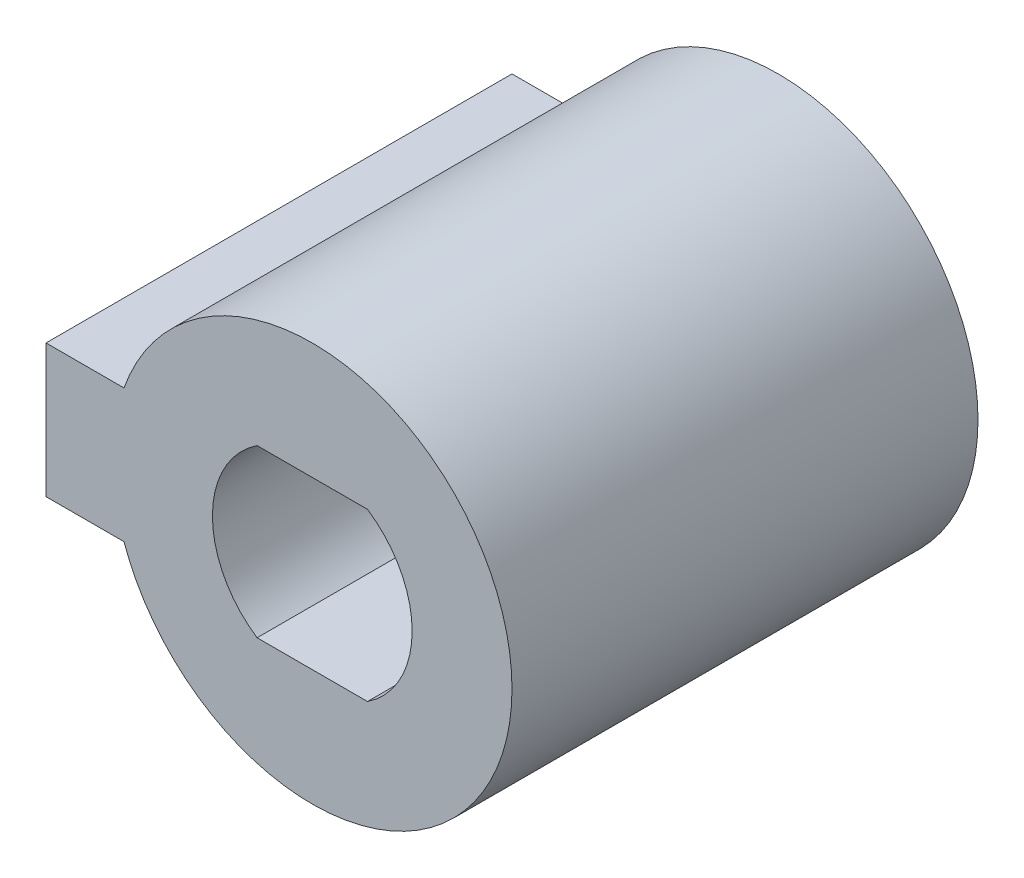
ISO-10303-21;
HEADER;
FILE_DESCRIPTION(('STEP AP214'),'2;1');
FILE_NAME('part.step','',(''),(''),'','','');
FILE_SCHEMA(('AUTOMOTIVE_DESIGN { 1 0 10303 214 1 1 1 1 }'));
ENDSEC;
DATA;
#1=APPLICATION_CONTEXT('core data for automotive mechanical design processes');
#2=APPLICATION_PROTOCOL_DEFINITION('international standard','automotive_design',2000,#1);
#3=PRODUCT_CONTEXT('',#1,'mechanical');
#4=PRODUCT('Part','Part','',(#3));
#5=PRODUCT_RELATED_PRODUCT_CATEGORY('part','',(#4));
#6=PRODUCT_DEFINITION_FORMATION('','',#4);
#7=PRODUCT_DEFINITION_CONTEXT('part definition',#1,'design');
#8=PRODUCT_DEFINITION('design','',#6,#7);
#9=PRODUCT_DEFINITION_SHAPE('','',#8);
#10=(LENGTH_UNIT() NAMED_UNIT(*) SI_UNIT(.MILLI.,.METRE.));
#11=(NAMED_UNIT(*) PLANE_ANGLE_UNIT() SI_UNIT($,.RADIAN.));
#12=(NAMED_UNIT(*) SI_UNIT($,.STERADIAN.) SOLID_ANGLE_UNIT());
#13=UNCERTAINTY_MEASURE_WITH_UNIT(LENGTH_MEASURE(1.E-05),#10,'distance_accuracy_value','');
#14=(GEOMETRIC_REPRESENTATION_CONTEXT(3) GLOBAL_UNCERTAINTY_ASSIGNED_CONTEXT((#13)) GLOBAL_UNIT_ASSIGNED_CONTEXT((#10,
#11,#12)) REPRESENTATION_CONTEXT('',''));
#15=CARTESIAN_POINT('',(0.,0.,0.));
#16=DIRECTION('',(0.,0.,1.));
#17=DIRECTION('',(1.,0.,0.));
#18=AXIS2_PLACEMENT_3D('',#15,#16,#17);
#19=CARTESIAN_POINT('',(0.,0.,-1.));
#20=DIRECTION('',(0.,0.,1.));
#21=DIRECTION('',(1.,0.,0.));
#22=AXIS2_PLACEMENT_3D('',#19,#20,#21);
#23=CYLINDRICAL_SURFACE('',#22,12.);
#24=DIRECTION('',(0.,0.,1.));
#25=VECTOR('',#24,1.);
#26=CARTESIAN_POINT('',(-11.3137084989848,4.,-1.));
#27=LINE('',#26,#25);
#28=CARTESIAN_POINT('',(-11.3137084989848,4.,-1.));
#29=VERTEX_POINT('',#28);
#30=CARTESIAN_POINT('',(-11.3137084989848,4.,27.));
#31=VERTEX_POINT('',#30);
#32=EDGE_CURVE('E39',#29,#31,#27,.T.);
#33=ORIENTED_EDGE('',*,*,#32,.T.);
#34=CARTESIAN_POINT('',(0.,0.,27.));
#35=DIRECTION('',(0.,0.,1.));
#36=DIRECTION('',(1.,0.,0.));
#37=AXIS2_PLACEMENT_3D('',#34,#35,#36);
#38=CIRCLE('',#37,12.);
#39=CARTESIAN_POINT('',(-11.3137084989848,-4.,27.));
#40=VERTEX_POINT('',#39);
#41=EDGE_CURVE('E122',#40,#31,#38,.T.);
#42=ORIENTED_EDGE('',*,*,#41,.F.);
#43=DIRECTION('',(0.,0.,1.));
#44=VECTOR('',#43,1.);
#45=CARTESIAN_POINT('',(-11.3137084989848,-4.,-1.));
#46=LINE('',#45,#44);
#47=CARTESIAN_POINT('',(-11.3137084989848,-4.,-1.));
#48=VERTEX_POINT('',#47);
#49=EDGE_CURVE('E12',#48,#40,#46,.T.);
#50=ORIENTED_EDGE('',*,*,#49,.F.);
#51=CARTESIAN_POINT('',(0.,0.,-1.));
#52=DIRECTION('',(0.,0.,1.));
#53=DIRECTION('',(1.,0.,0.));
#54=AXIS2_PLACEMENT_3D('',#51,#52,#53);
#55=CIRCLE('',#54,12.);
#56=EDGE_CURVE('E149',#48,#29,#55,.T.);
#57=ORIENTED_EDGE('',*,*,#56,.T.);
#58=EDGE_LOOP('',(#33,#42,#50,#57));
#59=FACE_BOUND('',#58,.T.);
#60=ADVANCED_FACE('F36',(#59),#23,.T.);
#61=CARTESIAN_POINT('',(-16.,-4.,-1.));
#62=DIRECTION('',(0.,-1.,0.));
#63=DIRECTION('',(0.,0.,-1.));
#64=AXIS2_PLACEMENT_3D('',#61,#62,#63);
#65=PLANE('',#64);
#66=ORIENTED_EDGE('',*,*,#49,.T.);
#67=DIRECTION('',(1.,0.,0.));
#68=VECTOR('',#67,1.);
#69=CARTESIAN_POINT('',(-16.,-4.,27.));
#70=LINE('',#69,#68);
#71=CARTESIAN_POINT('',(-16.,-4.,27.));
#72=VERTEX_POINT('',#71);
#73=EDGE_CURVE('E130',#72,#40,#70,.T.);
#74=ORIENTED_EDGE('',*,*,#73,.F.);
#75=DIRECTION('',(0.,0.,1.));
#76=VECTOR('',#75,1.);
#77=CARTESIAN_POINT('',(-16.,-4.,-1.));
#78=LINE('',#77,#76);
#79=CARTESIAN_POINT('',(-16.,-4.,-1.));
#80=VERTEX_POINT('',#79);
#81=EDGE_CURVE('E44',#80,#72,#78,.T.);
#82=ORIENTED_EDGE('',*,*,#81,.F.);
#83=DIRECTION('',(1.,0.,0.));
#84=VECTOR('',#83,1.);
#85=CARTESIAN_POINT('',(-16.,-4.,-1.));
#86=LINE('',#85,#84);
#87=EDGE_CURVE('E160',#80,#48,#86,.T.);
#88=ORIENTED_EDGE('',*,*,#87,.T.);
#89=EDGE_LOOP('',(#66,#74,#82,#88));
#90=FACE_BOUND('',#89,.T.);
#91=ADVANCED_FACE('F171',(#90),#65,.T.);
#92=CARTESIAN_POINT('',(-16.,4.,-1.));
#93=DIRECTION('',(-1.,0.,0.));
#94=DIRECTION('',(0.,0.,1.));
#95=AXIS2_PLACEMENT_3D('',#92,#93,#94);
#96=PLANE('',#95);
#97=ORIENTED_EDGE('',*,*,#81,.T.);
#98=DIRECTION('',(0.,-1.,0.));
#99=VECTOR('',#98,1.);
#100=CARTESIAN_POINT('',(-16.,4.,27.));
#101=LINE('',#100,#99);
#102=CARTESIAN_POINT('',(-16.,4.,27.));
#103=VERTEX_POINT('',#102);
#104=EDGE_CURVE('E133',#103,#72,#101,.T.);
#105=ORIENTED_EDGE('',*,*,#104,.F.);
#106=DIRECTION('',(0.,0.,1.));
#107=VECTOR('',#106,1.);
#108=CARTESIAN_POINT('',(-16.,4.,-1.));
#109=LINE('',#108,#107);
#110=CARTESIAN_POINT('',(-16.,4.,-1.));
#111=VERTEX_POINT('',#110);
#112=EDGE_CURVE('E163',#111,#103,#109,.T.);
#113=ORIENTED_EDGE('',*,*,#112,.F.);
#114=DIRECTION('',(0.,-1.,0.));
#115=VECTOR('',#114,1.);
#116=CARTESIAN_POINT('',(-16.,4.,-1.));
#117=LINE('',#116,#115);
#118=EDGE_CURVE('E157',#111,#80,#117,.T.);
#119=ORIENTED_EDGE('',*,*,#118,.T.);
#120=EDGE_LOOP('',(#97,#105,#113,#119));
#121=FACE_BOUND('',#120,.T.);
#122=ADVANCED_FACE('F177',(#121),#96,.T.);
#123=CARTESIAN_POINT('',(-11.3137084989848,4.,-1.));
#124=DIRECTION('',(0.,1.,0.));
#125=DIRECTION('',(0.,0.,1.));
#126=AXIS2_PLACEMENT_3D('',#123,#124,#125);
#127=PLANE('',#126);
#128=ORIENTED_EDGE('',*,*,#112,.T.);
#129=DIRECTION('',(-1.,0.,0.));
#130=VECTOR('',#129,1.);
#131=CARTESIAN_POINT('',(-11.3137084989848,4.,27.));
#132=LINE('',#131,#130);
#133=EDGE_CURVE('E136',#31,#103,#132,.T.);
#134=ORIENTED_EDGE('',*,*,#133,.F.);
#135=ORIENTED_EDGE('',*,*,#32,.F.);
#136=DIRECTION('',(-1.,0.,0.));
#137=VECTOR('',#136,1.);
#138=CARTESIAN_POINT('',(-11.3137084989848,4.,-1.));
#139=LINE('',#138,#137);
#140=EDGE_CURVE('E154',#29,#111,#139,.T.);
#141=ORIENTED_EDGE('',*,*,#140,.T.);
#142=EDGE_LOOP('',(#128,#134,#135,#141));
#143=FACE_BOUND('',#142,.T.);
#144=ADVANCED_FACE('F168',(#143),#127,.T.);
#145=CARTESIAN_POINT('',(0.,0.,-1.));
#146=DIRECTION('',(0.,0.,1.));
#147=DIRECTION('',(1.,0.,0.));
#148=AXIS2_PLACEMENT_3D('',#145,#146,#147);
#149=PLANE('',#148);
#150=DIRECTION('',(1.,0.,0.));
#151=VECTOR('',#150,1.);
#152=CARTESIAN_POINT('',(-3.3166247903554,-5.,-1.));
#153=LINE('',#152,#151);
#154=CARTESIAN_POINT('',(-3.3166247903554,-5.,-1.));
#155=VERTEX_POINT('',#154);
#156=CARTESIAN_POINT('',(3.3166247903554,-5.,-1.));
#157=VERTEX_POINT('',#156);
#158=EDGE_CURVE('E106',#155,#157,#153,.T.);
#159=ORIENTED_EDGE('',*,*,#158,.T.);
#160=CARTESIAN_POINT('',(0.,0.,-1.));
#161=DIRECTION('',(0.,0.,1.));
#162=DIRECTION('',(1.,0.,0.));
#163=AXIS2_PLACEMENT_3D('',#160,#161,#162);
#164=CIRCLE('',#163,6.);
#165=CARTESIAN_POINT('',(3.3166247903554,5.,-1.));
#166=VERTEX_POINT('',#165);
#167=EDGE_CURVE('E121',#157,#166,#164,.T.);
#168=ORIENTED_EDGE('',*,*,#167,.T.);
#169=DIRECTION('',(-1.,0.,0.));
#170=VECTOR('',#169,1.);
#171=CARTESIAN_POINT('',(3.3166247903554,5.,-1.));
#172=LINE('',#171,#170);
#173=CARTESIAN_POINT('',(-3.3166247903554,5.,-1.));
#174=VERTEX_POINT('',#173);
#175=EDGE_CURVE('E143',#166,#174,#172,.T.);
#176=ORIENTED_EDGE('',*,*,#175,.T.);
#177=CARTESIAN_POINT('',(0.,0.,-1.));
#178=DIRECTION('',(0.,0.,1.));
#179=DIRECTION('',(1.,0.,0.));
#180=AXIS2_PLACEMENT_3D('',#177,#178,#179);
#181=CIRCLE('',#180,6.);
#182=EDGE_CURVE('E52',#174,#155,#181,.T.);
#183=ORIENTED_EDGE('',*,*,#182,.T.);
#184=EDGE_LOOP('',(#159,#168,#176,#183));
#185=FACE_BOUND('',#184,.T.);
#186=ORIENTED_EDGE('',*,*,#56,.F.);
#187=ORIENTED_EDGE('',*,*,#87,.F.);
#188=ORIENTED_EDGE('',*,*,#118,.F.);
#189=ORIENTED_EDGE('',*,*,#140,.F.);
#190=EDGE_LOOP('',(#186,#187,#188,#189));
#191=FACE_BOUND('',#190,.T.);
#192=ADVANCED_FACE('F175',(#185,#191),#149,.F.);
#193=CARTESIAN_POINT('',(0.,0.,-1.));
#194=DIRECTION('',(0.,0.,1.));
#195=DIRECTION('',(1.,0.,0.));
#196=AXIS2_PLACEMENT_3D('',#193,#194,#195);
#197=CYLINDRICAL_SURFACE('',#196,6.);
#198=DIRECTION('',(0.,0.,1.));
#199=VECTOR('',#198,1.);
#200=CARTESIAN_POINT('',(3.3166247903554,-5.,-1.));
#201=LINE('',#200,#199);
#202=CARTESIAN_POINT('',(3.3166247903554,-5.,27.));
#203=VERTEX_POINT('',#202);
#204=EDGE_CURVE('E108',#157,#203,#201,.T.);
#205=ORIENTED_EDGE('',*,*,#204,.T.);
#206=CARTESIAN_POINT('',(0.,0.,27.));
#207=DIRECTION('',(0.,0.,1.));
#208=DIRECTION('',(1.,0.,0.));
#209=AXIS2_PLACEMENT_3D('',#206,#207,#208);
#210=CIRCLE('',#209,6.);
#211=CARTESIAN_POINT('',(3.3166247903554,5.,27.));
#212=VERTEX_POINT('',#211);
#213=EDGE_CURVE('E120',#203,#212,#210,.T.);
#214=ORIENTED_EDGE('',*,*,#213,.T.);
#215=DIRECTION('',(0.,0.,1.));
#216=VECTOR('',#215,1.);
#217=CARTESIAN_POINT('',(3.3166247903554,5.,-1.));
#218=LINE('',#217,#216);
#219=EDGE_CURVE('E148',#166,#212,#218,.T.);
#220=ORIENTED_EDGE('',*,*,#219,.F.);
#221=ORIENTED_EDGE('',*,*,#167,.F.);
#222=EDGE_LOOP('',(#205,#214,#220,#221));
#223=FACE_BOUND('',#222,.T.);
#224=ADVANCED_FACE('F211',(#223),#197,.F.);
#225=CARTESIAN_POINT('',(-3.3166247903554,-5.,-1.));
#226=DIRECTION('',(0.,-1.,0.));
#227=DIRECTION('',(0.,0.,-1.));
#228=AXIS2_PLACEMENT_3D('',#225,#226,#227);
#229=PLANE('',#228);
#230=DIRECTION('',(0.,0.,1.));
#231=VECTOR('',#230,1.);
#232=CARTESIAN_POINT('',(-3.3166247903554,-5.,-1.));
#233=LINE('',#232,#231);
#234=CARTESIAN_POINT('',(-3.3166247903554,-5.,27.));
#235=VERTEX_POINT('',#234);
#236=EDGE_CURVE('E101',#155,#235,#233,.T.);
#237=ORIENTED_EDGE('',*,*,#236,.T.);
#238=DIRECTION('',(1.,0.,0.));
#239=VECTOR('',#238,1.);
#240=CARTESIAN_POINT('',(-3.3166247903554,-5.,27.));
#241=LINE('',#240,#239);
#242=EDGE_CURVE('E104',#235,#203,#241,.T.);
#243=ORIENTED_EDGE('',*,*,#242,.T.);
#244=ORIENTED_EDGE('',*,*,#204,.F.);
#245=ORIENTED_EDGE('',*,*,#158,.F.);
#246=EDGE_LOOP('',(#237,#243,#244,#245));
#247=FACE_BOUND('',#246,.T.);
#248=ADVANCED_FACE('F103',(#247),#229,.F.);
#249=CARTESIAN_POINT('',(0.,0.,-1.));
#250=DIRECTION('',(0.,0.,1.));
#251=DIRECTION('',(1.,0.,0.));
#252=AXIS2_PLACEMENT_3D('',#249,#250,#251);
#253=CYLINDRICAL_SURFACE('',#252,6.);
#254=DIRECTION('',(0.,0.,1.));
#255=VECTOR('',#254,1.);
#256=CARTESIAN_POINT('',(-3.3166247903554,5.,-1.));
#257=LINE('',#256,#255);
#258=CARTESIAN_POINT('',(-3.3166247903554,5.,27.));
#259=VERTEX_POINT('',#258);
#260=EDGE_CURVE('E109',#174,#259,#257,.T.);
#261=ORIENTED_EDGE('',*,*,#260,.T.);
#262=CARTESIAN_POINT('',(0.,0.,27.));
#263=DIRECTION('',(0.,0.,1.));
#264=DIRECTION('',(1.,0.,0.));
#265=AXIS2_PLACEMENT_3D('',#262,#263,#264);
#266=CIRCLE('',#265,6.);
#267=EDGE_CURVE('E117',#259,#235,#266,.T.);
#268=ORIENTED_EDGE('',*,*,#267,.T.);
#269=ORIENTED_EDGE('',*,*,#236,.F.);
#270=ORIENTED_EDGE('',*,*,#182,.F.);
#271=EDGE_LOOP('',(#261,#268,#269,#270));
#272=FACE_BOUND('',#271,.T.);
#273=ADVANCED_FACE('F124',(#272),#253,.F.);
#274=CARTESIAN_POINT('',(3.3166247903554,5.,-1.));
#275=DIRECTION('',(0.,1.,0.));
#276=DIRECTION('',(0.,0.,1.));
#277=AXIS2_PLACEMENT_3D('',#274,#275,#276);
#278=PLANE('',#277);
#279=ORIENTED_EDGE('',*,*,#219,.T.);
#280=DIRECTION('',(-1.,0.,0.));
#281=VECTOR('',#280,1.);
#282=CARTESIAN_POINT('',(3.3166247903554,5.,27.));
#283=LINE('',#282,#281);
#284=EDGE_CURVE('E125',#212,#259,#283,.T.);
#285=ORIENTED_EDGE('',*,*,#284,.T.);
#286=ORIENTED_EDGE('',*,*,#260,.F.);
#287=ORIENTED_EDGE('',*,*,#175,.F.);
#288=EDGE_LOOP('',(#279,#285,#286,#287));
#289=FACE_BOUND('',#288,.T.);
#290=ADVANCED_FACE('F238',(#289),#278,.F.);
#291=CARTESIAN_POINT('',(0.,6.,27.));
#292=DIRECTION('',(0.,0.,1.));
#293=DIRECTION('',(1.,0.,0.));
#294=AXIS2_PLACEMENT_3D('',#291,#292,#293);
#295=PLANE('',#294);
#296=ORIENTED_EDGE('',*,*,#213,.F.);
#297=ORIENTED_EDGE('',*,*,#242,.F.);
#298=ORIENTED_EDGE('',*,*,#267,.F.);
#299=ORIENTED_EDGE('',*,*,#284,.F.);
#300=EDGE_LOOP('',(#296,#297,#298,#299));
#301=FACE_BOUND('',#300,.T.);
#302=ORIENTED_EDGE('',*,*,#73,.T.);
#303=ORIENTED_EDGE('',*,*,#41,.T.);
#304=ORIENTED_EDGE('',*,*,#133,.T.);
#305=ORIENTED_EDGE('',*,*,#104,.T.);
#306=EDGE_LOOP('',(#302,#303,#304,#305));
#307=FACE_BOUND('',#306,.T.);
#308=ADVANCED_FACE('F114',(#301,#307),#295,.T.);
#309=CLOSED_SHELL('',(#60,#91,#122,#144,#192,#224,#248,#273,#290,#308));
#310=MANIFOLD_SOLID_BREP('B2',#309);
#311=ADVANCED_BREP_SHAPE_REPRESENTATION('',(#18,#310),#14);
#312=SHAPE_DEFINITION_REPRESENTATION(#9,#311);
ENDSEC;
END-ISO-10303-21;
